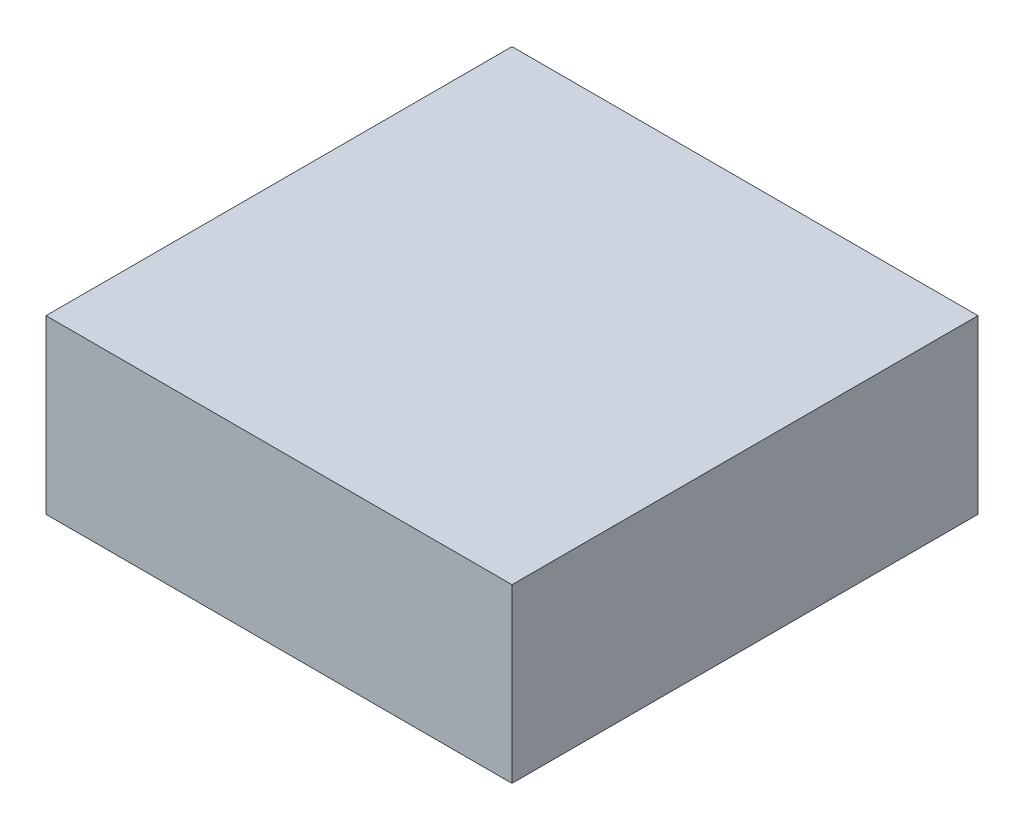
ISO-10303-21;
HEADER;
FILE_DESCRIPTION(('STEP AP214'),'2;1');
FILE_NAME('part.step','',(''),(''),'','','');
FILE_SCHEMA(('AUTOMOTIVE_DESIGN { 1 0 10303 214 1 1 1 1 }'));
ENDSEC;
DATA;
#1=APPLICATION_CONTEXT('core data for automotive mechanical design processes');
#2=APPLICATION_PROTOCOL_DEFINITION('international standard','automotive_design',2000,#1);
#3=PRODUCT_CONTEXT('',#1,'mechanical');
#4=PRODUCT('Part','Part','',(#3));
#5=PRODUCT_RELATED_PRODUCT_CATEGORY('part','',(#4));
#6=PRODUCT_DEFINITION_FORMATION('','',#4);
#7=PRODUCT_DEFINITION_CONTEXT('part definition',#1,'design');
#8=PRODUCT_DEFINITION('design','',#6,#7);
#9=PRODUCT_DEFINITION_SHAPE('','',#8);
#10=(LENGTH_UNIT() NAMED_UNIT(*) SI_UNIT(.MILLI.,.METRE.));
#11=(NAMED_UNIT(*) PLANE_ANGLE_UNIT() SI_UNIT($,.RADIAN.));
#12=(NAMED_UNIT(*) SI_UNIT($,.STERADIAN.) SOLID_ANGLE_UNIT());
#13=UNCERTAINTY_MEASURE_WITH_UNIT(LENGTH_MEASURE(1.E-05),#10,'distance_accuracy_value','');
#14=(GEOMETRIC_REPRESENTATION_CONTEXT(3) GLOBAL_UNCERTAINTY_ASSIGNED_CONTEXT((#13)) GLOBAL_UNIT_ASSIGNED_CONTEXT((#10,
#11,#12)) REPRESENTATION_CONTEXT('',''));
#15=CARTESIAN_POINT('',(0.,0.,0.));
#16=DIRECTION('',(0.,0.,1.));
#17=DIRECTION('',(1.,0.,0.));
#18=AXIS2_PLACEMENT_3D('',#15,#16,#17);
#19=CARTESIAN_POINT('',(0.812500000000001,0.6,0.812499999999997));
#20=DIRECTION('',(-1.,0.,0.));
#21=DIRECTION('',(0.,0.,1.));
#22=AXIS2_PLACEMENT_3D('',#19,#20,#21);
#23=PLANE('',#22);
#24=DIRECTION('',(0.,0.,-1.));
#25=VECTOR('',#24,1.);
#26=CARTESIAN_POINT('',(0.812500000000001,0.,0.812499999999997));
#27=LINE('',#26,#25);
#28=CARTESIAN_POINT('',(0.812500000000001,0.,0.812499999999997));
#29=VERTEX_POINT('',#28);
#30=CARTESIAN_POINT('',(0.812500000000001,0.,-0.812500000000004));
#31=VERTEX_POINT('',#30);
#32=EDGE_CURVE('E101',#29,#31,#27,.T.);
#33=ORIENTED_EDGE('',*,*,#32,.T.);
#34=DIRECTION('',(0.,-1.,0.));
#35=VECTOR('',#34,1.);
#36=CARTESIAN_POINT('',(0.812500000000001,0.6,-0.812500000000004));
#37=LINE('',#36,#35);
#38=CARTESIAN_POINT('',(0.812500000000001,0.6,-0.812500000000004));
#39=VERTEX_POINT('',#38);
#40=EDGE_CURVE('E11',#39,#31,#37,.T.);
#41=ORIENTED_EDGE('',*,*,#40,.F.);
#42=DIRECTION('',(0.,0.,-1.));
#43=VECTOR('',#42,1.);
#44=CARTESIAN_POINT('',(0.812500000000001,0.6,0.812499999999997));
#45=LINE('',#44,#43);
#46=CARTESIAN_POINT('',(0.812500000000001,0.6,0.812499999999997));
#47=VERTEX_POINT('',#46);
#48=EDGE_CURVE('E89',#47,#39,#45,.T.);
#49=ORIENTED_EDGE('',*,*,#48,.F.);
#50=DIRECTION('',(0.,-1.,0.));
#51=VECTOR('',#50,1.);
#52=CARTESIAN_POINT('',(0.812500000000001,0.6,0.812499999999997));
#53=LINE('',#52,#51);
#54=EDGE_CURVE('E97',#47,#29,#53,.T.);
#55=ORIENTED_EDGE('',*,*,#54,.T.);
#56=EDGE_LOOP('',(#33,#41,#49,#55));
#57=FACE_BOUND('',#56,.T.);
#58=ADVANCED_FACE('F38',(#57),#23,.F.);
#59=CARTESIAN_POINT('',(-0.812499999999999,0.6,-0.812500000000004));
#60=DIRECTION('',(0.,0.,1.));
#61=DIRECTION('',(1.,0.,0.));
#62=AXIS2_PLACEMENT_3D('',#59,#60,#61);
#63=PLANE('',#62);
#64=DIRECTION('',(-1.,0.,0.));
#65=VECTOR('',#64,1.);
#66=CARTESIAN_POINT('',(-0.812499999999999,0.,-0.812500000000004));
#67=LINE('',#66,#65);
#68=CARTESIAN_POINT('',(-0.812499999999999,0.,-0.812500000000004));
#69=VERTEX_POINT('',#68);
#70=EDGE_CURVE('E93',#31,#69,#67,.T.);
#71=ORIENTED_EDGE('',*,*,#70,.T.);
#72=DIRECTION('',(0.,-1.,0.));
#73=VECTOR('',#72,1.);
#74=CARTESIAN_POINT('',(-0.812499999999999,0.6,-0.812500000000004));
#75=LINE('',#74,#73);
#76=CARTESIAN_POINT('',(-0.812499999999999,0.6,-0.812500000000004));
#77=VERTEX_POINT('',#76);
#78=EDGE_CURVE('E46',#77,#69,#75,.T.);
#79=ORIENTED_EDGE('',*,*,#78,.F.);
#80=DIRECTION('',(-1.,0.,0.));
#81=VECTOR('',#80,1.);
#82=CARTESIAN_POINT('',(-0.812499999999999,0.6,-0.812500000000004));
#83=LINE('',#82,#81);
#84=EDGE_CURVE('E84',#39,#77,#83,.T.);
#85=ORIENTED_EDGE('',*,*,#84,.F.);
#86=ORIENTED_EDGE('',*,*,#40,.T.);
#87=EDGE_LOOP('',(#71,#79,#85,#86));
#88=FACE_BOUND('',#87,.T.);
#89=ADVANCED_FACE('F92',(#88),#63,.F.);
#90=CARTESIAN_POINT('',(-0.812499999999999,0.6,0.812499999999997));
#91=DIRECTION('',(1.,0.,0.));
#92=DIRECTION('',(0.,0.,-1.));
#93=AXIS2_PLACEMENT_3D('',#90,#91,#92);
#94=PLANE('',#93);
#95=DIRECTION('',(0.,0.,1.));
#96=VECTOR('',#95,1.);
#97=CARTESIAN_POINT('',(-0.812499999999999,0.,0.812499999999997));
#98=LINE('',#97,#96);
#99=CARTESIAN_POINT('',(-0.812499999999999,0.,0.812499999999997));
#100=VERTEX_POINT('',#99);
#101=EDGE_CURVE('E71',#69,#100,#98,.T.);
#102=ORIENTED_EDGE('',*,*,#101,.T.);
#103=DIRECTION('',(0.,-1.,0.));
#104=VECTOR('',#103,1.);
#105=CARTESIAN_POINT('',(-0.812499999999999,0.6,0.812499999999997));
#106=LINE('',#105,#104);
#107=CARTESIAN_POINT('',(-0.812499999999999,0.6,0.812499999999997));
#108=VERTEX_POINT('',#107);
#109=EDGE_CURVE('E94',#108,#100,#106,.T.);
#110=ORIENTED_EDGE('',*,*,#109,.F.);
#111=DIRECTION('',(0.,0.,1.));
#112=VECTOR('',#111,1.);
#113=CARTESIAN_POINT('',(-0.812499999999999,0.6,0.812499999999997));
#114=LINE('',#113,#112);
#115=EDGE_CURVE('E87',#77,#108,#114,.T.);
#116=ORIENTED_EDGE('',*,*,#115,.F.);
#117=ORIENTED_EDGE('',*,*,#78,.T.);
#118=EDGE_LOOP('',(#102,#110,#116,#117));
#119=FACE_BOUND('',#118,.T.);
#120=ADVANCED_FACE('F95',(#119),#94,.F.);
#121=CARTESIAN_POINT('',(-0.812499999999999,0.6,0.812499999999997));
#122=DIRECTION('',(0.,0.,-1.));
#123=DIRECTION('',(-1.,0.,0.));
#124=AXIS2_PLACEMENT_3D('',#121,#122,#123);
#125=PLANE('',#124);
#126=DIRECTION('',(1.,0.,0.));
#127=VECTOR('',#126,1.);
#128=CARTESIAN_POINT('',(-0.812499999999999,0.,0.812499999999997));
#129=LINE('',#128,#127);
#130=EDGE_CURVE('E77',#100,#29,#129,.T.);
#131=ORIENTED_EDGE('',*,*,#130,.T.);
#132=ORIENTED_EDGE('',*,*,#54,.F.);
#133=DIRECTION('',(1.,0.,0.));
#134=VECTOR('',#133,1.);
#135=CARTESIAN_POINT('',(-0.812499999999999,0.6,0.812499999999997));
#136=LINE('',#135,#134);
#137=EDGE_CURVE('E54',#108,#47,#136,.T.);
#138=ORIENTED_EDGE('',*,*,#137,.F.);
#139=ORIENTED_EDGE('',*,*,#109,.T.);
#140=EDGE_LOOP('',(#131,#132,#138,#139));
#141=FACE_BOUND('',#140,.T.);
#142=ADVANCED_FACE('F108',(#141),#125,.F.);
#143=CARTESIAN_POINT('',(0.8125,0.6,-0.812500000000004));
#144=DIRECTION('',(0.,-1.,0.));
#145=DIRECTION('',(0.,0.,-1.));
#146=AXIS2_PLACEMENT_3D('',#143,#144,#145);
#147=PLANE('',#146);
#148=ORIENTED_EDGE('',*,*,#48,.T.);
#149=ORIENTED_EDGE('',*,*,#84,.T.);
#150=ORIENTED_EDGE('',*,*,#115,.T.);
#151=ORIENTED_EDGE('',*,*,#137,.T.);
#152=EDGE_LOOP('',(#148,#149,#150,#151));
#153=FACE_BOUND('',#152,.T.);
#154=ADVANCED_FACE('F85',(#153),#147,.F.);
#155=CARTESIAN_POINT('',(0.8125,0.,-0.812500000000004));
#156=DIRECTION('',(0.,-1.,0.));
#157=DIRECTION('',(0.,0.,-1.));
#158=AXIS2_PLACEMENT_3D('',#155,#156,#157);
#159=PLANE('',#158);
#160=ORIENTED_EDGE('',*,*,#32,.F.);
#161=ORIENTED_EDGE('',*,*,#130,.F.);
#162=ORIENTED_EDGE('',*,*,#101,.F.);
#163=ORIENTED_EDGE('',*,*,#70,.F.);
#164=EDGE_LOOP('',(#160,#161,#162,#163));
#165=FACE_BOUND('',#164,.T.);
#166=ADVANCED_FACE('F111',(#165),#159,.T.);
#167=CLOSED_SHELL('',(#58,#89,#120,#142,#154,#166));
#168=MANIFOLD_SOLID_BREP('B2',#167);
#169=ADVANCED_BREP_SHAPE_REPRESENTATION('',(#18,#168),#14);
#170=SHAPE_DEFINITION_REPRESENTATION(#9,#169);
ENDSEC;
END-ISO-10303-21;
